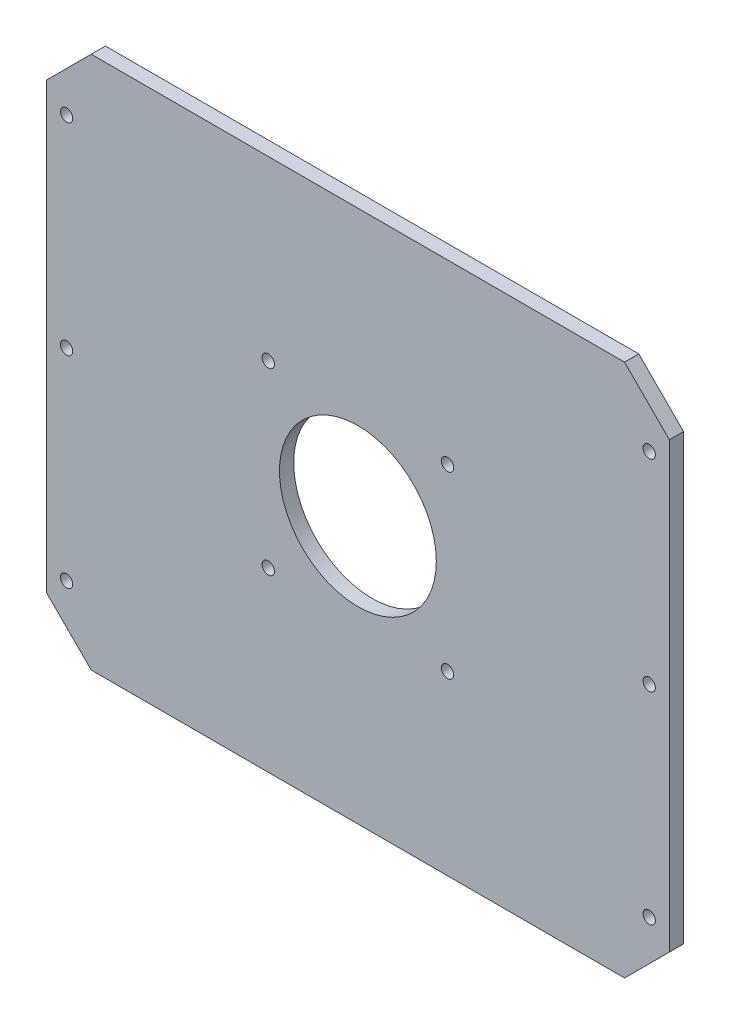
ISO-10303-21;
HEADER;
FILE_DESCRIPTION(('STEP AP214'),'2;1');
FILE_NAME('part.step','',(''),(''),'','','');
FILE_SCHEMA(('AUTOMOTIVE_DESIGN { 1 0 10303 214 1 1 1 1 }'));
ENDSEC;
DATA;
#1=APPLICATION_CONTEXT('core data for automotive mechanical design processes');
#2=APPLICATION_PROTOCOL_DEFINITION('international standard','automotive_design',2000,#1);
#3=PRODUCT_CONTEXT('',#1,'mechanical');
#4=PRODUCT('Part','Part','',(#3));
#5=PRODUCT_RELATED_PRODUCT_CATEGORY('part','',(#4));
#6=PRODUCT_DEFINITION_FORMATION('','',#4);
#7=PRODUCT_DEFINITION_CONTEXT('part definition',#1,'design');
#8=PRODUCT_DEFINITION('design','',#6,#7);
#9=PRODUCT_DEFINITION_SHAPE('','',#8);
#10=(LENGTH_UNIT() NAMED_UNIT(*) SI_UNIT(.MILLI.,.METRE.));
#11=(NAMED_UNIT(*) PLANE_ANGLE_UNIT() SI_UNIT($,.RADIAN.));
#12=(NAMED_UNIT(*) SI_UNIT($,.STERADIAN.) SOLID_ANGLE_UNIT());
#13=UNCERTAINTY_MEASURE_WITH_UNIT(LENGTH_MEASURE(1.E-05),#10,'distance_accuracy_value','');
#14=(GEOMETRIC_REPRESENTATION_CONTEXT(3) GLOBAL_UNCERTAINTY_ASSIGNED_CONTEXT((#13)) GLOBAL_UNIT_ASSIGNED_CONTEXT((#10,
#11,#12)) REPRESENTATION_CONTEXT('',''));
#15=CARTESIAN_POINT('',(0.,0.,0.));
#16=DIRECTION('',(0.,0.,1.));
#17=DIRECTION('',(1.,0.,0.));
#18=AXIS2_PLACEMENT_3D('',#15,#16,#17);
#19=CARTESIAN_POINT('',(-139.,-119.,6.35));
#20=DIRECTION('',(1.,0.,0.));
#21=DIRECTION('',(0.,0.,-1.));
#22=AXIS2_PLACEMENT_3D('',#19,#20,#21);
#23=PLANE('',#22);
#24=DIRECTION('',(0.,-1.,0.));
#25=VECTOR('',#24,1.);
#26=CARTESIAN_POINT('',(-139.,-119.,6.35));
#27=LINE('',#26,#25);
#28=CARTESIAN_POINT('',(-139.,98.9999999999999,6.35));
#29=VERTEX_POINT('',#28);
#30=CARTESIAN_POINT('',(-139.,-98.9999999999999,6.35));
#31=VERTEX_POINT('',#30);
#32=EDGE_CURVE('E130',#29,#31,#27,.T.);
#33=ORIENTED_EDGE('',*,*,#32,.F.);
#34=DIRECTION('',(0.,0.,-1.));
#35=VECTOR('',#34,1.);
#36=CARTESIAN_POINT('',(-139.,98.9999999999999,6.35));
#37=LINE('',#36,#35);
#38=CARTESIAN_POINT('',(-139.,98.9999999999999,0.));
#39=VERTEX_POINT('',#38);
#40=EDGE_CURVE('E11',#29,#39,#37,.T.);
#41=ORIENTED_EDGE('',*,*,#40,.T.);
#42=DIRECTION('',(0.,-1.,0.));
#43=VECTOR('',#42,1.);
#44=CARTESIAN_POINT('',(-139.,-119.,0.));
#45=LINE('',#44,#43);
#46=CARTESIAN_POINT('',(-139.,-98.9999999999999,0.));
#47=VERTEX_POINT('',#46);
#48=EDGE_CURVE('E132',#39,#47,#45,.T.);
#49=ORIENTED_EDGE('',*,*,#48,.T.);
#50=DIRECTION('',(0.,0.,1.));
#51=VECTOR('',#50,1.);
#52=CARTESIAN_POINT('',(-139.,-98.9999999999999,6.35));
#53=LINE('',#52,#51);
#54=EDGE_CURVE('E42',#47,#31,#53,.T.);
#55=ORIENTED_EDGE('',*,*,#54,.T.);
#56=EDGE_LOOP('',(#33,#41,#49,#55));
#57=FACE_BOUND('',#56,.T.);
#58=ADVANCED_FACE('F33',(#57),#23,.F.);
#59=CARTESIAN_POINT('',(139.,-119.,6.35));
#60=DIRECTION('',(0.,1.,0.));
#61=DIRECTION('',(-1.,0.,0.));
#62=AXIS2_PLACEMENT_3D('',#59,#60,#61);
#63=PLANE('',#62);
#64=DIRECTION('',(1.,0.,0.));
#65=VECTOR('',#64,1.);
#66=CARTESIAN_POINT('',(139.,-119.,0.));
#67=LINE('',#66,#65);
#68=CARTESIAN_POINT('',(-119.,-119.,0.));
#69=VERTEX_POINT('',#68);
#70=CARTESIAN_POINT('',(119.,-119.,0.));
#71=VERTEX_POINT('',#70);
#72=EDGE_CURVE('E128',#69,#71,#67,.T.);
#73=ORIENTED_EDGE('',*,*,#72,.T.);
#74=DIRECTION('',(0.,0.,1.));
#75=VECTOR('',#74,1.);
#76=CARTESIAN_POINT('',(119.,-119.,6.35));
#77=LINE('',#76,#75);
#78=CARTESIAN_POINT('',(119.,-119.,6.35));
#79=VERTEX_POINT('',#78);
#80=EDGE_CURVE('E107',#71,#79,#77,.T.);
#81=ORIENTED_EDGE('',*,*,#80,.T.);
#82=DIRECTION('',(1.,0.,0.));
#83=VECTOR('',#82,1.);
#84=CARTESIAN_POINT('',(139.,-119.,6.35));
#85=LINE('',#84,#83);
#86=CARTESIAN_POINT('',(-119.,-119.,6.35));
#87=VERTEX_POINT('',#86);
#88=EDGE_CURVE('E225',#87,#79,#85,.T.);
#89=ORIENTED_EDGE('',*,*,#88,.F.);
#90=DIRECTION('',(0.,0.,-1.));
#91=VECTOR('',#90,1.);
#92=CARTESIAN_POINT('',(-119.,-119.,6.35));
#93=LINE('',#92,#91);
#94=EDGE_CURVE('E112',#87,#69,#93,.T.);
#95=ORIENTED_EDGE('',*,*,#94,.T.);
#96=EDGE_LOOP('',(#73,#81,#89,#95));
#97=FACE_BOUND('',#96,.T.);
#98=ADVANCED_FACE('F241',(#97),#63,.F.);
#99=CARTESIAN_POINT('',(139.,-119.,6.35));
#100=DIRECTION('',(-1.,0.,0.));
#101=DIRECTION('',(0.,0.,1.));
#102=AXIS2_PLACEMENT_3D('',#99,#100,#101);
#103=PLANE('',#102);
#104=DIRECTION('',(0.,1.,0.));
#105=VECTOR('',#104,1.);
#106=CARTESIAN_POINT('',(139.,-119.,6.35));
#107=LINE('',#106,#105);
#108=CARTESIAN_POINT('',(139.,-99.,6.35));
#109=VERTEX_POINT('',#108);
#110=CARTESIAN_POINT('',(139.,98.9999999999999,6.35));
#111=VERTEX_POINT('',#110);
#112=EDGE_CURVE('E121',#109,#111,#107,.T.);
#113=ORIENTED_EDGE('',*,*,#112,.F.);
#114=DIRECTION('',(0.,0.,-1.));
#115=VECTOR('',#114,1.);
#116=CARTESIAN_POINT('',(139.,-98.9999999999999,6.35));
#117=LINE('',#116,#115);
#118=CARTESIAN_POINT('',(139.,-98.9999999999999,0.));
#119=VERTEX_POINT('',#118);
#120=EDGE_CURVE('E106',#109,#119,#117,.T.);
#121=ORIENTED_EDGE('',*,*,#120,.T.);
#122=DIRECTION('',(0.,1.,0.));
#123=VECTOR('',#122,1.);
#124=CARTESIAN_POINT('',(139.,-119.,0.));
#125=LINE('',#124,#123);
#126=CARTESIAN_POINT('',(139.,98.9999999999999,0.));
#127=VERTEX_POINT('',#126);
#128=EDGE_CURVE('E119',#119,#127,#125,.T.);
#129=ORIENTED_EDGE('',*,*,#128,.T.);
#130=DIRECTION('',(0.,0.,1.));
#131=VECTOR('',#130,1.);
#132=CARTESIAN_POINT('',(139.,98.9999999999999,6.35));
#133=LINE('',#132,#131);
#134=EDGE_CURVE('E123',#127,#111,#133,.T.);
#135=ORIENTED_EDGE('',*,*,#134,.T.);
#136=EDGE_LOOP('',(#113,#121,#129,#135));
#137=FACE_BOUND('',#136,.T.);
#138=ADVANCED_FACE('F118',(#137),#103,.F.);
#139=CARTESIAN_POINT('',(139.,119.,6.35));
#140=DIRECTION('',(0.,-1.,0.));
#141=DIRECTION('',(1.,0.,0.));
#142=AXIS2_PLACEMENT_3D('',#139,#140,#141);
#143=PLANE('',#142);
#144=DIRECTION('',(-1.,0.,0.));
#145=VECTOR('',#144,1.);
#146=CARTESIAN_POINT('',(139.,119.,6.35));
#147=LINE('',#146,#145);
#148=CARTESIAN_POINT('',(119.,119.,6.35));
#149=VERTEX_POINT('',#148);
#150=CARTESIAN_POINT('',(-119.,119.,6.35));
#151=VERTEX_POINT('',#150);
#152=EDGE_CURVE('E136',#149,#151,#147,.T.);
#153=ORIENTED_EDGE('',*,*,#152,.F.);
#154=DIRECTION('',(0.,0.,-1.));
#155=VECTOR('',#154,1.);
#156=CARTESIAN_POINT('',(119.,119.,6.35));
#157=LINE('',#156,#155);
#158=CARTESIAN_POINT('',(119.,119.,0.));
#159=VERTEX_POINT('',#158);
#160=EDGE_CURVE('E153',#149,#159,#157,.T.);
#161=ORIENTED_EDGE('',*,*,#160,.T.);
#162=DIRECTION('',(-1.,0.,0.));
#163=VECTOR('',#162,1.);
#164=CARTESIAN_POINT('',(139.,119.,0.));
#165=LINE('',#164,#163);
#166=CARTESIAN_POINT('',(-119.,119.,0.));
#167=VERTEX_POINT('',#166);
#168=EDGE_CURVE('E127',#159,#167,#165,.T.);
#169=ORIENTED_EDGE('',*,*,#168,.T.);
#170=DIRECTION('',(0.,0.,1.));
#171=VECTOR('',#170,1.);
#172=CARTESIAN_POINT('',(-119.,119.,6.35));
#173=LINE('',#172,#171);
#174=EDGE_CURVE('E50',#167,#151,#173,.T.);
#175=ORIENTED_EDGE('',*,*,#174,.T.);
#176=EDGE_LOOP('',(#153,#161,#169,#175));
#177=FACE_BOUND('',#176,.T.);
#178=ADVANCED_FACE('F248',(#177),#143,.F.);
#179=CARTESIAN_POINT('',(0.,0.,6.35));
#180=DIRECTION('',(0.,0.,1.));
#181=DIRECTION('',(1.,0.,0.));
#182=AXIS2_PLACEMENT_3D('',#179,#180,#181);
#183=PLANE('',#182);
#184=CARTESIAN_POINT('',(129.999999999998,0.,6.35));
#185=DIRECTION('',(0.,0.,1.));
#186=DIRECTION('',(-1.,0.,0.));
#187=AXIS2_PLACEMENT_3D('',#184,#185,#186);
#188=CIRCLE('',#187,2.75000000000001);
#189=CARTESIAN_POINT('',(127.249999999998,0.,6.35));
#190=VERTEX_POINT('',#189);
#191=EDGE_CURVE('E185',#190,#190,#188,.T.);
#192=ORIENTED_EDGE('',*,*,#191,.F.);
#193=EDGE_LOOP('',(#192));
#194=FACE_BOUND('',#193,.T.);
#195=CARTESIAN_POINT('',(-129.999999999998,0.,6.35));
#196=DIRECTION('',(0.,0.,1.));
#197=DIRECTION('',(1.,0.,0.));
#198=AXIS2_PLACEMENT_3D('',#195,#196,#197);
#199=CIRCLE('',#198,2.75000000000001);
#200=CARTESIAN_POINT('',(-127.249999999998,0.,6.35));
#201=VERTEX_POINT('',#200);
#202=EDGE_CURVE('E175',#201,#201,#199,.T.);
#203=ORIENTED_EDGE('',*,*,#202,.F.);
#204=EDGE_LOOP('',(#203));
#205=FACE_BOUND('',#204,.T.);
#206=CARTESIAN_POINT('',(130.,-90.,6.35));
#207=DIRECTION('',(0.,0.,1.));
#208=DIRECTION('',(1.,0.,0.));
#209=AXIS2_PLACEMENT_3D('',#206,#207,#208);
#210=CIRCLE('',#209,2.75000000000001);
#211=CARTESIAN_POINT('',(132.75,-90.,6.35));
#212=VERTEX_POINT('',#211);
#213=EDGE_CURVE('E172',#212,#212,#210,.T.);
#214=ORIENTED_EDGE('',*,*,#213,.F.);
#215=EDGE_LOOP('',(#214));
#216=FACE_BOUND('',#215,.T.);
#217=CARTESIAN_POINT('',(-130.,-90.,6.35));
#218=DIRECTION('',(0.,0.,1.));
#219=DIRECTION('',(-1.,0.,0.));
#220=AXIS2_PLACEMENT_3D('',#217,#218,#219);
#221=CIRCLE('',#220,2.75000000000001);
#222=CARTESIAN_POINT('',(-132.75,-90.,6.35));
#223=VERTEX_POINT('',#222);
#224=EDGE_CURVE('E169',#223,#223,#221,.T.);
#225=ORIENTED_EDGE('',*,*,#224,.F.);
#226=EDGE_LOOP('',(#225));
#227=FACE_BOUND('',#226,.T.);
#228=CARTESIAN_POINT('',(130.,90.,6.35));
#229=DIRECTION('',(0.,0.,1.));
#230=DIRECTION('',(-1.,0.,0.));
#231=AXIS2_PLACEMENT_3D('',#228,#229,#230);
#232=CIRCLE('',#231,2.75000000000001);
#233=CARTESIAN_POINT('',(127.25,90.,6.35));
#234=VERTEX_POINT('',#233);
#235=EDGE_CURVE('E165',#234,#234,#232,.T.);
#236=ORIENTED_EDGE('',*,*,#235,.F.);
#237=EDGE_LOOP('',(#236));
#238=FACE_BOUND('',#237,.T.);
#239=CARTESIAN_POINT('',(-130.,90.,6.35));
#240=DIRECTION('',(0.,0.,1.));
#241=DIRECTION('',(1.,0.,0.));
#242=AXIS2_PLACEMENT_3D('',#239,#240,#241);
#243=CIRCLE('',#242,2.75000000000001);
#244=CARTESIAN_POINT('',(-127.25,90.,6.35));
#245=VERTEX_POINT('',#244);
#246=EDGE_CURVE('E161',#245,#245,#243,.T.);
#247=ORIENTED_EDGE('',*,*,#246,.F.);
#248=EDGE_LOOP('',(#247));
#249=FACE_BOUND('',#248,.T.);
#250=CARTESIAN_POINT('',(-40.,-40.,6.35));
#251=DIRECTION('',(0.,0.,1.));
#252=DIRECTION('',(-1.,0.,0.));
#253=AXIS2_PLACEMENT_3D('',#250,#251,#252);
#254=CIRCLE('',#253,2.75);
#255=CARTESIAN_POINT('',(-42.75,-40.,6.35));
#256=VERTEX_POINT('',#255);
#257=EDGE_CURVE('E160',#256,#256,#254,.T.);
#258=ORIENTED_EDGE('',*,*,#257,.F.);
#259=EDGE_LOOP('',(#258));
#260=FACE_BOUND('',#259,.T.);
#261=CARTESIAN_POINT('',(40.,-40.,6.35));
#262=DIRECTION('',(0.,0.,1.));
#263=DIRECTION('',(1.,0.,0.));
#264=AXIS2_PLACEMENT_3D('',#261,#262,#263);
#265=CIRCLE('',#264,2.75);
#266=CARTESIAN_POINT('',(42.75,-40.,6.35));
#267=VERTEX_POINT('',#266);
#268=EDGE_CURVE('E197',#267,#267,#265,.T.);
#269=ORIENTED_EDGE('',*,*,#268,.F.);
#270=EDGE_LOOP('',(#269));
#271=FACE_BOUND('',#270,.T.);
#272=CARTESIAN_POINT('',(40.,40.,6.35));
#273=DIRECTION('',(0.,0.,1.));
#274=DIRECTION('',(-1.,0.,0.));
#275=AXIS2_PLACEMENT_3D('',#272,#273,#274);
#276=CIRCLE('',#275,2.75);
#277=CARTESIAN_POINT('',(37.25,40.,6.35));
#278=VERTEX_POINT('',#277);
#279=EDGE_CURVE('E203',#278,#278,#276,.T.);
#280=ORIENTED_EDGE('',*,*,#279,.F.);
#281=EDGE_LOOP('',(#280));
#282=FACE_BOUND('',#281,.T.);
#283=CARTESIAN_POINT('',(-40.,40.,6.35));
#284=DIRECTION('',(0.,0.,1.));
#285=DIRECTION('',(1.,0.,0.));
#286=AXIS2_PLACEMENT_3D('',#283,#284,#285);
#287=CIRCLE('',#286,2.75);
#288=CARTESIAN_POINT('',(-37.25,40.,6.35));
#289=VERTEX_POINT('',#288);
#290=EDGE_CURVE('E209',#289,#289,#287,.T.);
#291=ORIENTED_EDGE('',*,*,#290,.F.);
#292=EDGE_LOOP('',(#291));
#293=FACE_BOUND('',#292,.T.);
#294=CARTESIAN_POINT('',(0.,0.,6.35));
#295=DIRECTION('',(0.,0.,1.));
#296=DIRECTION('',(1.,0.,0.));
#297=AXIS2_PLACEMENT_3D('',#294,#295,#296);
#298=CIRCLE('',#297,35.);
#299=CARTESIAN_POINT('',(35.,0.,6.35));
#300=VERTEX_POINT('',#299);
#301=EDGE_CURVE('E215',#300,#300,#298,.T.);
#302=ORIENTED_EDGE('',*,*,#301,.F.);
#303=EDGE_LOOP('',(#302));
#304=FACE_BOUND('',#303,.T.);
#305=ORIENTED_EDGE('',*,*,#88,.T.);
#306=DIRECTION('',(-0.707106781186549,-0.707106781186547,0.));
#307=VECTOR('',#306,1.);
#308=CARTESIAN_POINT('',(119.,-119.,6.35));
#309=LINE('',#308,#307);
#310=EDGE_CURVE('E150',#79,#109,#309,.F.);
#311=ORIENTED_EDGE('',*,*,#310,.T.);
#312=ORIENTED_EDGE('',*,*,#112,.T.);
#313=DIRECTION('',(0.707106781186545,-0.70710678118655,0.));
#314=VECTOR('',#313,1.);
#315=CARTESIAN_POINT('',(119.000000000001,119.,6.35));
#316=LINE('',#315,#314);
#317=EDGE_CURVE('E57',#111,#149,#316,.F.);
#318=ORIENTED_EDGE('',*,*,#317,.T.);
#319=ORIENTED_EDGE('',*,*,#152,.T.);
#320=DIRECTION('',(0.707106781186548,0.707106781186547,0.));
#321=VECTOR('',#320,1.);
#322=CARTESIAN_POINT('',(-119.,119.,6.35));
#323=LINE('',#322,#321);
#324=EDGE_CURVE('E147',#151,#29,#323,.F.);
#325=ORIENTED_EDGE('',*,*,#324,.T.);
#326=ORIENTED_EDGE('',*,*,#32,.T.);
#327=DIRECTION('',(-0.707106781186546,0.70710678118655,0.));
#328=VECTOR('',#327,1.);
#329=CARTESIAN_POINT('',(-119.,-119.,6.35));
#330=LINE('',#329,#328);
#331=EDGE_CURVE('E145',#31,#87,#330,.F.);
#332=ORIENTED_EDGE('',*,*,#331,.T.);
#333=EDGE_LOOP('',(#305,#311,#312,#318,#319,#325,#326,#332));
#334=FACE_BOUND('',#333,.T.);
#335=ADVANCED_FACE('F239',(#194,#205,#216,#227,#238,#249,#260,#271,#282,#293,#304,#334),#183,.T.);
#336=CARTESIAN_POINT('',(0.,0.,0.));
#337=DIRECTION('',(0.,0.,1.));
#338=DIRECTION('',(1.,0.,0.));
#339=AXIS2_PLACEMENT_3D('',#336,#337,#338);
#340=PLANE('',#339);
#341=CARTESIAN_POINT('',(129.999999999998,0.,0.));
#342=DIRECTION('',(0.,0.,1.));
#343=DIRECTION('',(1.,0.,0.));
#344=AXIS2_PLACEMENT_3D('',#341,#342,#343);
#345=CIRCLE('',#344,2.75000000000001);
#346=CARTESIAN_POINT('',(132.749999999998,0.,0.));
#347=VERTEX_POINT('',#346);
#348=EDGE_CURVE('E37',#347,#347,#345,.T.);
#349=ORIENTED_EDGE('',*,*,#348,.T.);
#350=EDGE_LOOP('',(#349));
#351=FACE_BOUND('',#350,.T.);
#352=CARTESIAN_POINT('',(-129.999999999998,0.,0.));
#353=DIRECTION('',(0.,0.,1.));
#354=DIRECTION('',(1.,0.,0.));
#355=AXIS2_PLACEMENT_3D('',#352,#353,#354);
#356=CIRCLE('',#355,2.75000000000001);
#357=CARTESIAN_POINT('',(-127.249999999998,0.,0.));
#358=VERTEX_POINT('',#357);
#359=EDGE_CURVE('E173',#358,#358,#356,.T.);
#360=ORIENTED_EDGE('',*,*,#359,.T.);
#361=EDGE_LOOP('',(#360));
#362=FACE_BOUND('',#361,.T.);
#363=CARTESIAN_POINT('',(130.,-90.,0.));
#364=DIRECTION('',(0.,0.,1.));
#365=DIRECTION('',(1.,0.,0.));
#366=AXIS2_PLACEMENT_3D('',#363,#364,#365);
#367=CIRCLE('',#366,2.75000000000001);
#368=CARTESIAN_POINT('',(132.75,-90.,0.));
#369=VERTEX_POINT('',#368);
#370=EDGE_CURVE('E170',#369,#369,#367,.T.);
#371=ORIENTED_EDGE('',*,*,#370,.T.);
#372=EDGE_LOOP('',(#371));
#373=FACE_BOUND('',#372,.T.);
#374=CARTESIAN_POINT('',(-130.,-90.,0.));
#375=DIRECTION('',(0.,0.,1.));
#376=DIRECTION('',(1.,0.,0.));
#377=AXIS2_PLACEMENT_3D('',#374,#375,#376);
#378=CIRCLE('',#377,2.75000000000001);
#379=CARTESIAN_POINT('',(-127.25,-90.,0.));
#380=VERTEX_POINT('',#379);
#381=EDGE_CURVE('E166',#380,#380,#378,.T.);
#382=ORIENTED_EDGE('',*,*,#381,.T.);
#383=EDGE_LOOP('',(#382));
#384=FACE_BOUND('',#383,.T.);
#385=CARTESIAN_POINT('',(130.,90.,0.));
#386=DIRECTION('',(0.,0.,1.));
#387=DIRECTION('',(1.,0.,0.));
#388=AXIS2_PLACEMENT_3D('',#385,#386,#387);
#389=CIRCLE('',#388,2.75000000000001);
#390=CARTESIAN_POINT('',(132.75,90.,0.));
#391=VERTEX_POINT('',#390);
#392=EDGE_CURVE('E162',#391,#391,#389,.T.);
#393=ORIENTED_EDGE('',*,*,#392,.T.);
#394=EDGE_LOOP('',(#393));
#395=FACE_BOUND('',#394,.T.);
#396=CARTESIAN_POINT('',(-130.,90.,0.));
#397=DIRECTION('',(0.,0.,1.));
#398=DIRECTION('',(1.,0.,0.));
#399=AXIS2_PLACEMENT_3D('',#396,#397,#398);
#400=CIRCLE('',#399,2.75000000000001);
#401=CARTESIAN_POINT('',(-127.25,90.,0.));
#402=VERTEX_POINT('',#401);
#403=EDGE_CURVE('E157',#402,#402,#400,.T.);
#404=ORIENTED_EDGE('',*,*,#403,.T.);
#405=EDGE_LOOP('',(#404));
#406=FACE_BOUND('',#405,.T.);
#407=CARTESIAN_POINT('',(-40.,-40.,0.));
#408=DIRECTION('',(0.,0.,1.));
#409=DIRECTION('',(-1.,0.,0.));
#410=AXIS2_PLACEMENT_3D('',#407,#408,#409);
#411=CIRCLE('',#410,2.75);
#412=CARTESIAN_POINT('',(-42.75,-40.,0.));
#413=VERTEX_POINT('',#412);
#414=EDGE_CURVE('E194',#413,#413,#411,.T.);
#415=ORIENTED_EDGE('',*,*,#414,.T.);
#416=EDGE_LOOP('',(#415));
#417=FACE_BOUND('',#416,.T.);
#418=CARTESIAN_POINT('',(40.,-40.,0.));
#419=DIRECTION('',(0.,0.,1.));
#420=DIRECTION('',(1.,0.,0.));
#421=AXIS2_PLACEMENT_3D('',#418,#419,#420);
#422=CIRCLE('',#421,2.75);
#423=CARTESIAN_POINT('',(42.75,-40.,0.));
#424=VERTEX_POINT('',#423);
#425=EDGE_CURVE('E200',#424,#424,#422,.T.);
#426=ORIENTED_EDGE('',*,*,#425,.T.);
#427=EDGE_LOOP('',(#426));
#428=FACE_BOUND('',#427,.T.);
#429=CARTESIAN_POINT('',(40.,40.,0.));
#430=DIRECTION('',(0.,0.,1.));
#431=DIRECTION('',(-1.,0.,0.));
#432=AXIS2_PLACEMENT_3D('',#429,#430,#431);
#433=CIRCLE('',#432,2.75);
#434=CARTESIAN_POINT('',(37.25,40.,0.));
#435=VERTEX_POINT('',#434);
#436=EDGE_CURVE('E206',#435,#435,#433,.T.);
#437=ORIENTED_EDGE('',*,*,#436,.T.);
#438=EDGE_LOOP('',(#437));
#439=FACE_BOUND('',#438,.T.);
#440=CARTESIAN_POINT('',(-40.,40.,0.));
#441=DIRECTION('',(0.,0.,1.));
#442=DIRECTION('',(1.,0.,0.));
#443=AXIS2_PLACEMENT_3D('',#440,#441,#442);
#444=CIRCLE('',#443,2.75);
#445=CARTESIAN_POINT('',(-37.25,40.,0.));
#446=VERTEX_POINT('',#445);
#447=EDGE_CURVE('E212',#446,#446,#444,.T.);
#448=ORIENTED_EDGE('',*,*,#447,.T.);
#449=EDGE_LOOP('',(#448));
#450=FACE_BOUND('',#449,.T.);
#451=CARTESIAN_POINT('',(0.,0.,0.));
#452=DIRECTION('',(0.,0.,1.));
#453=DIRECTION('',(1.,0.,0.));
#454=AXIS2_PLACEMENT_3D('',#451,#452,#453);
#455=CIRCLE('',#454,35.);
#456=CARTESIAN_POINT('',(35.,0.,0.));
#457=VERTEX_POINT('',#456);
#458=EDGE_CURVE('E218',#457,#457,#455,.T.);
#459=ORIENTED_EDGE('',*,*,#458,.T.);
#460=EDGE_LOOP('',(#459));
#461=FACE_BOUND('',#460,.T.);
#462=ORIENTED_EDGE('',*,*,#128,.F.);
#463=DIRECTION('',(0.707106781186549,0.707106781186547,0.));
#464=VECTOR('',#463,1.);
#465=CARTESIAN_POINT('',(139.,-98.9999999999999,0.));
#466=LINE('',#465,#464);
#467=EDGE_CURVE('E102',#119,#71,#466,.F.);
#468=ORIENTED_EDGE('',*,*,#467,.T.);
#469=ORIENTED_EDGE('',*,*,#72,.F.);
#470=DIRECTION('',(0.707106781186546,-0.70710678118655,0.));
#471=VECTOR('',#470,1.);
#472=CARTESIAN_POINT('',(-119.,-119.,0.));
#473=LINE('',#472,#471);
#474=EDGE_CURVE('E122',#69,#47,#473,.F.);
#475=ORIENTED_EDGE('',*,*,#474,.T.);
#476=ORIENTED_EDGE('',*,*,#48,.F.);
#477=DIRECTION('',(-0.707106781186548,-0.707106781186547,0.));
#478=VECTOR('',#477,1.);
#479=CARTESIAN_POINT('',(-139.,98.9999999999999,0.));
#480=LINE('',#479,#478);
#481=EDGE_CURVE('E139',#39,#167,#480,.F.);
#482=ORIENTED_EDGE('',*,*,#481,.T.);
#483=ORIENTED_EDGE('',*,*,#168,.F.);
#484=DIRECTION('',(-0.707106781186545,0.70710678118655,0.));
#485=VECTOR('',#484,1.);
#486=CARTESIAN_POINT('',(119.,119.,0.));
#487=LINE('',#486,#485);
#488=EDGE_CURVE('E113',#159,#127,#487,.F.);
#489=ORIENTED_EDGE('',*,*,#488,.T.);
#490=EDGE_LOOP('',(#462,#468,#469,#475,#476,#482,#483,#489));
#491=FACE_BOUND('',#490,.T.);
#492=ADVANCED_FACE('F125',(#351,#362,#373,#384,#395,#406,#417,#428,#439,#450,#461,#491),#340,.F.);
#493=CARTESIAN_POINT('',(0.,0.,0.));
#494=DIRECTION('',(0.,0.,1.));
#495=DIRECTION('',(1.,0.,0.));
#496=AXIS2_PLACEMENT_3D('',#493,#494,#495);
#497=CYLINDRICAL_SURFACE('',#496,35.);
#498=ORIENTED_EDGE('',*,*,#458,.F.);
#499=EDGE_LOOP('',(#498));
#500=FACE_BOUND('',#499,.T.);
#501=ORIENTED_EDGE('',*,*,#301,.T.);
#502=EDGE_LOOP('',(#501));
#503=FACE_BOUND('',#502,.T.);
#504=ADVANCED_FACE('F276',(#500,#503),#497,.F.);
#505=CARTESIAN_POINT('',(-40.,40.,0.));
#506=DIRECTION('',(0.,0.,1.));
#507=DIRECTION('',(1.,0.,0.));
#508=AXIS2_PLACEMENT_3D('',#505,#506,#507);
#509=CYLINDRICAL_SURFACE('',#508,2.75);
#510=ORIENTED_EDGE('',*,*,#447,.F.);
#511=EDGE_LOOP('',(#510));
#512=FACE_BOUND('',#511,.T.);
#513=ORIENTED_EDGE('',*,*,#290,.T.);
#514=EDGE_LOOP('',(#513));
#515=FACE_BOUND('',#514,.T.);
#516=ADVANCED_FACE('F281',(#512,#515),#509,.F.);
#517=CARTESIAN_POINT('',(40.,40.,0.));
#518=DIRECTION('',(0.,0.,1.));
#519=DIRECTION('',(1.,0.,0.));
#520=AXIS2_PLACEMENT_3D('',#517,#518,#519);
#521=CYLINDRICAL_SURFACE('',#520,2.75);
#522=ORIENTED_EDGE('',*,*,#436,.F.);
#523=EDGE_LOOP('',(#522));
#524=FACE_BOUND('',#523,.T.);
#525=ORIENTED_EDGE('',*,*,#279,.T.);
#526=EDGE_LOOP('',(#525));
#527=FACE_BOUND('',#526,.T.);
#528=ADVANCED_FACE('F285',(#524,#527),#521,.F.);
#529=CARTESIAN_POINT('',(40.,-40.,0.));
#530=DIRECTION('',(0.,0.,1.));
#531=DIRECTION('',(1.,0.,0.));
#532=AXIS2_PLACEMENT_3D('',#529,#530,#531);
#533=CYLINDRICAL_SURFACE('',#532,2.75);
#534=ORIENTED_EDGE('',*,*,#425,.F.);
#535=EDGE_LOOP('',(#534));
#536=FACE_BOUND('',#535,.T.);
#537=ORIENTED_EDGE('',*,*,#268,.T.);
#538=EDGE_LOOP('',(#537));
#539=FACE_BOUND('',#538,.T.);
#540=ADVANCED_FACE('F289',(#536,#539),#533,.F.);
#541=CARTESIAN_POINT('',(-40.,-40.,0.));
#542=DIRECTION('',(0.,0.,1.));
#543=DIRECTION('',(1.,0.,0.));
#544=AXIS2_PLACEMENT_3D('',#541,#542,#543);
#545=CYLINDRICAL_SURFACE('',#544,2.75);
#546=ORIENTED_EDGE('',*,*,#414,.F.);
#547=EDGE_LOOP('',(#546));
#548=FACE_BOUND('',#547,.T.);
#549=ORIENTED_EDGE('',*,*,#257,.T.);
#550=EDGE_LOOP('',(#549));
#551=FACE_BOUND('',#550,.T.);
#552=ADVANCED_FACE('F256',(#548,#551),#545,.F.);
#553=CARTESIAN_POINT('',(139.,-98.9999999999999,6.35));
#554=DIRECTION('',(-0.707106781186547,0.707106781186549,0.));
#555=DIRECTION('',(0.,0.,-1.));
#556=AXIS2_PLACEMENT_3D('',#553,#554,#555);
#557=PLANE('',#556);
#558=ORIENTED_EDGE('',*,*,#310,.F.);
#559=ORIENTED_EDGE('',*,*,#80,.F.);
#560=ORIENTED_EDGE('',*,*,#467,.F.);
#561=ORIENTED_EDGE('',*,*,#120,.F.);
#562=EDGE_LOOP('',(#558,#559,#560,#561));
#563=FACE_BOUND('',#562,.T.);
#564=ADVANCED_FACE('F105',(#563),#557,.F.);
#565=CARTESIAN_POINT('',(119.,119.,6.35));
#566=DIRECTION('',(-0.707106781186551,-0.707106781186545,0.));
#567=DIRECTION('',(0.,0.,-1.));
#568=AXIS2_PLACEMENT_3D('',#565,#566,#567);
#569=PLANE('',#568);
#570=ORIENTED_EDGE('',*,*,#317,.F.);
#571=ORIENTED_EDGE('',*,*,#134,.F.);
#572=ORIENTED_EDGE('',*,*,#488,.F.);
#573=ORIENTED_EDGE('',*,*,#160,.F.);
#574=EDGE_LOOP('',(#570,#571,#572,#573));
#575=FACE_BOUND('',#574,.T.);
#576=ADVANCED_FACE('F255',(#575),#569,.F.);
#577=CARTESIAN_POINT('',(-139.,98.9999999999999,6.35));
#578=DIRECTION('',(0.707106781186547,-0.707106781186548,0.));
#579=DIRECTION('',(0.,0.,-1.));
#580=AXIS2_PLACEMENT_3D('',#577,#578,#579);
#581=PLANE('',#580);
#582=ORIENTED_EDGE('',*,*,#324,.F.);
#583=ORIENTED_EDGE('',*,*,#174,.F.);
#584=ORIENTED_EDGE('',*,*,#481,.F.);
#585=ORIENTED_EDGE('',*,*,#40,.F.);
#586=EDGE_LOOP('',(#582,#583,#584,#585));
#587=FACE_BOUND('',#586,.T.);
#588=ADVANCED_FACE('F258',(#587),#581,.F.);
#589=CARTESIAN_POINT('',(-119.,-119.,6.35));
#590=DIRECTION('',(0.707106781186549,0.707106781186545,0.));
#591=DIRECTION('',(0.,0.,-1.));
#592=AXIS2_PLACEMENT_3D('',#589,#590,#591);
#593=PLANE('',#592);
#594=ORIENTED_EDGE('',*,*,#331,.F.);
#595=ORIENTED_EDGE('',*,*,#54,.F.);
#596=ORIENTED_EDGE('',*,*,#474,.F.);
#597=ORIENTED_EDGE('',*,*,#94,.F.);
#598=EDGE_LOOP('',(#594,#595,#596,#597));
#599=FACE_BOUND('',#598,.T.);
#600=ADVANCED_FACE('F35',(#599),#593,.F.);
#601=CARTESIAN_POINT('',(-130.,90.,-69.85));
#602=DIRECTION('',(0.,0.,1.));
#603=DIRECTION('',(1.,0.,0.));
#604=AXIS2_PLACEMENT_3D('',#601,#602,#603);
#605=CYLINDRICAL_SURFACE('',#604,2.75000000000001);
#606=ORIENTED_EDGE('',*,*,#246,.T.);
#607=EDGE_LOOP('',(#606));
#608=FACE_BOUND('',#607,.T.);
#609=ORIENTED_EDGE('',*,*,#403,.F.);
#610=EDGE_LOOP('',(#609));
#611=FACE_BOUND('',#610,.T.);
#612=ADVANCED_FACE('F265',(#608,#611),#605,.F.);
#613=CARTESIAN_POINT('',(130.,90.,-69.85));
#614=DIRECTION('',(0.,0.,1.));
#615=DIRECTION('',(1.,0.,0.));
#616=AXIS2_PLACEMENT_3D('',#613,#614,#615);
#617=CYLINDRICAL_SURFACE('',#616,2.75000000000001);
#618=ORIENTED_EDGE('',*,*,#235,.T.);
#619=EDGE_LOOP('',(#618));
#620=FACE_BOUND('',#619,.T.);
#621=ORIENTED_EDGE('',*,*,#392,.F.);
#622=EDGE_LOOP('',(#621));
#623=FACE_BOUND('',#622,.T.);
#624=ADVANCED_FACE('F299',(#620,#623),#617,.F.);
#625=CARTESIAN_POINT('',(-130.,-90.,-69.85));
#626=DIRECTION('',(0.,0.,1.));
#627=DIRECTION('',(1.,0.,0.));
#628=AXIS2_PLACEMENT_3D('',#625,#626,#627);
#629=CYLINDRICAL_SURFACE('',#628,2.75000000000001);
#630=ORIENTED_EDGE('',*,*,#224,.T.);
#631=EDGE_LOOP('',(#630));
#632=FACE_BOUND('',#631,.T.);
#633=ORIENTED_EDGE('',*,*,#381,.F.);
#634=EDGE_LOOP('',(#633));
#635=FACE_BOUND('',#634,.T.);
#636=ADVANCED_FACE('F303',(#632,#635),#629,.F.);
#637=CARTESIAN_POINT('',(130.,-90.,-69.85));
#638=DIRECTION('',(0.,0.,1.));
#639=DIRECTION('',(1.,0.,0.));
#640=AXIS2_PLACEMENT_3D('',#637,#638,#639);
#641=CYLINDRICAL_SURFACE('',#640,2.75000000000001);
#642=ORIENTED_EDGE('',*,*,#213,.T.);
#643=EDGE_LOOP('',(#642));
#644=FACE_BOUND('',#643,.T.);
#645=ORIENTED_EDGE('',*,*,#370,.F.);
#646=EDGE_LOOP('',(#645));
#647=FACE_BOUND('',#646,.T.);
#648=ADVANCED_FACE('F307',(#644,#647),#641,.F.);
#649=CARTESIAN_POINT('',(-129.999999999998,0.,-69.85));
#650=DIRECTION('',(0.,0.,1.));
#651=DIRECTION('',(1.,0.,0.));
#652=AXIS2_PLACEMENT_3D('',#649,#650,#651);
#653=CYLINDRICAL_SURFACE('',#652,2.75000000000001);
#654=ORIENTED_EDGE('',*,*,#202,.T.);
#655=EDGE_LOOP('',(#654));
#656=FACE_BOUND('',#655,.T.);
#657=ORIENTED_EDGE('',*,*,#359,.F.);
#658=EDGE_LOOP('',(#657));
#659=FACE_BOUND('',#658,.T.);
#660=ADVANCED_FACE('F311',(#656,#659),#653,.F.);
#661=CARTESIAN_POINT('',(129.999999999998,0.,-69.85));
#662=DIRECTION('',(0.,0.,1.));
#663=DIRECTION('',(1.,0.,0.));
#664=AXIS2_PLACEMENT_3D('',#661,#662,#663);
#665=CYLINDRICAL_SURFACE('',#664,2.75000000000001);
#666=ORIENTED_EDGE('',*,*,#191,.T.);
#667=EDGE_LOOP('',(#666));
#668=FACE_BOUND('',#667,.T.);
#669=ORIENTED_EDGE('',*,*,#348,.F.);
#670=EDGE_LOOP('',(#669));
#671=FACE_BOUND('',#670,.T.);
#672=ADVANCED_FACE('F315',(#668,#671),#665,.F.);
#673=CLOSED_SHELL('',(#58,#98,#138,#178,#335,#492,#504,#516,#528,#540,#552,#564,#576,#588,#600,
#612,#624,#636,#648,#660,#672));
#674=MANIFOLD_SOLID_BREP('B2',#673);
#675=ADVANCED_BREP_SHAPE_REPRESENTATION('',(#18,#674),#14);
#676=SHAPE_DEFINITION_REPRESENTATION(#9,#675);
ENDSEC;
END-ISO-10303-21;
